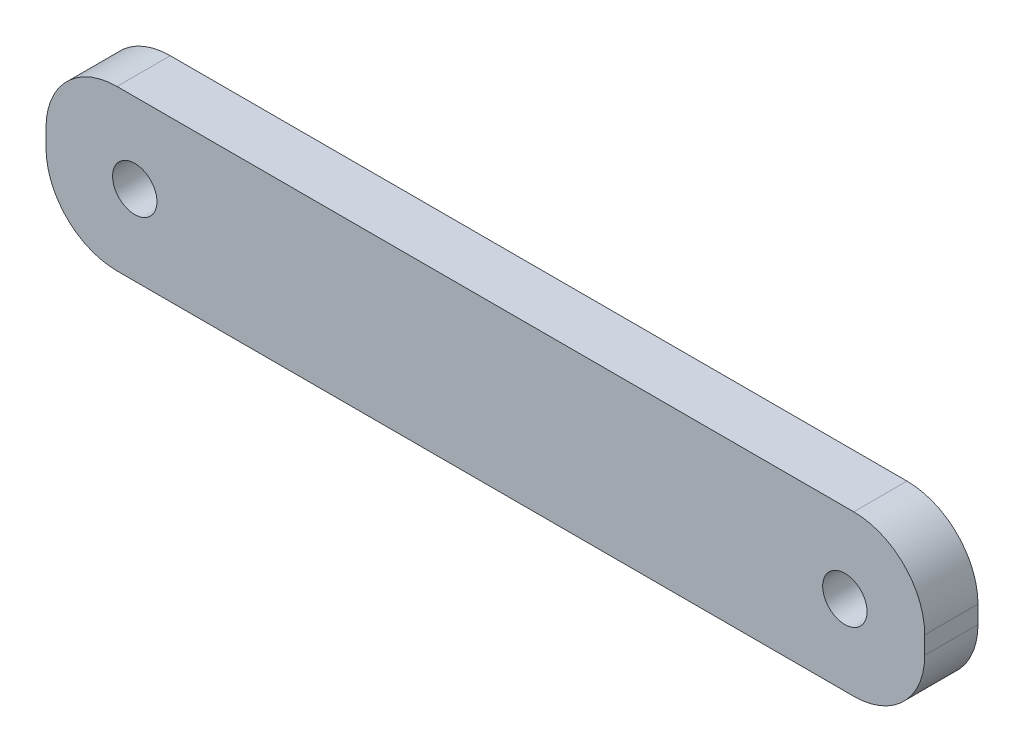
ISO-10303-21;
HEADER;
FILE_DESCRIPTION(('STEP AP214'),'2;1');
FILE_NAME('part.step','',(''),(''),'','','');
FILE_SCHEMA(('AUTOMOTIVE_DESIGN { 1 0 10303 214 1 1 1 1 }'));
ENDSEC;
DATA;
#1=APPLICATION_CONTEXT('core data for automotive mechanical design processes');
#2=APPLICATION_PROTOCOL_DEFINITION('international standard','automotive_design',2000,#1);
#3=PRODUCT_CONTEXT('',#1,'mechanical');
#4=PRODUCT('Part','Part','',(#3));
#5=PRODUCT_RELATED_PRODUCT_CATEGORY('part','',(#4));
#6=PRODUCT_DEFINITION_FORMATION('','',#4);
#7=PRODUCT_DEFINITION_CONTEXT('part definition',#1,'design');
#8=PRODUCT_DEFINITION('design','',#6,#7);
#9=PRODUCT_DEFINITION_SHAPE('','',#8);
#10=(LENGTH_UNIT() NAMED_UNIT(*) SI_UNIT(.MILLI.,.METRE.));
#11=(NAMED_UNIT(*) PLANE_ANGLE_UNIT() SI_UNIT($,.RADIAN.));
#12=(NAMED_UNIT(*) SI_UNIT($,.STERADIAN.) SOLID_ANGLE_UNIT());
#13=UNCERTAINTY_MEASURE_WITH_UNIT(LENGTH_MEASURE(1.E-05),#10,'distance_accuracy_value','');
#14=(GEOMETRIC_REPRESENTATION_CONTEXT(3) GLOBAL_UNCERTAINTY_ASSIGNED_CONTEXT((#13)) GLOBAL_UNIT_ASSIGNED_CONTEXT((#10,
#11,#12)) REPRESENTATION_CONTEXT('',''));
#15=CARTESIAN_POINT('',(0.,0.,0.));
#16=DIRECTION('',(0.,0.,1.));
#17=DIRECTION('',(1.,0.,0.));
#18=AXIS2_PLACEMENT_3D('',#15,#16,#17);
#19=CARTESIAN_POINT('',(0.,0.,-3.));
#20=DIRECTION('',(-1.,0.,0.));
#21=DIRECTION('',(0.,0.,1.));
#22=AXIS2_PLACEMENT_3D('',#19,#20,#21);
#23=PLANE('',#22);
#24=DIRECTION('',(0.,-1.,0.));
#25=VECTOR('',#24,1.);
#26=CARTESIAN_POINT('',(0.,0.,-3.));
#27=LINE('',#26,#25);
#28=CARTESIAN_POINT('',(0.,5.,-3.));
#29=VERTEX_POINT('',#28);
#30=CARTESIAN_POINT('',(0.,4.,-3.));
#31=VERTEX_POINT('',#30);
#32=EDGE_CURVE('E172',#29,#31,#27,.T.);
#33=ORIENTED_EDGE('',*,*,#32,.T.);
#34=DIRECTION('',(0.,0.,1.));
#35=VECTOR('',#34,1.);
#36=CARTESIAN_POINT('',(0.,4.,-3.));
#37=LINE('',#36,#35);
#38=CARTESIAN_POINT('',(0.,4.,0.));
#39=VERTEX_POINT('',#38);
#40=EDGE_CURVE('E13',#31,#39,#37,.T.);
#41=ORIENTED_EDGE('',*,*,#40,.T.);
#42=DIRECTION('',(0.,-1.,0.));
#43=VECTOR('',#42,1.);
#44=CARTESIAN_POINT('',(0.,0.,0.));
#45=LINE('',#44,#43);
#46=CARTESIAN_POINT('',(0.,5.,0.));
#47=VERTEX_POINT('',#46);
#48=EDGE_CURVE('E175',#47,#39,#45,.T.);
#49=ORIENTED_EDGE('',*,*,#48,.F.);
#50=DIRECTION('',(0.,0.,1.));
#51=VECTOR('',#50,1.);
#52=CARTESIAN_POINT('',(0.,5.,-3.));
#53=LINE('',#52,#51);
#54=EDGE_CURVE('E60',#47,#29,#53,.F.);
#55=ORIENTED_EDGE('',*,*,#54,.T.);
#56=EDGE_LOOP('',(#33,#41,#49,#55));
#57=FACE_BOUND('',#56,.T.);
#58=ADVANCED_FACE('F52',(#57),#23,.T.);
#59=CARTESIAN_POINT('',(0.,9.,-3.));
#60=DIRECTION('',(0.,1.,0.));
#61=DIRECTION('',(0.,0.,1.));
#62=AXIS2_PLACEMENT_3D('',#59,#60,#61);
#63=PLANE('',#62);
#64=DIRECTION('',(-1.,0.,0.));
#65=VECTOR('',#64,1.);
#66=CARTESIAN_POINT('',(0.,9.,0.));
#67=LINE('',#66,#65);
#68=CARTESIAN_POINT('',(45.5,9.,0.));
#69=VERTEX_POINT('',#68);
#70=CARTESIAN_POINT('',(4.,9.,0.));
#71=VERTEX_POINT('',#70);
#72=EDGE_CURVE('E138',#69,#71,#67,.T.);
#73=ORIENTED_EDGE('',*,*,#72,.F.);
#74=DIRECTION('',(0.,0.,1.));
#75=VECTOR('',#74,1.);
#76=CARTESIAN_POINT('',(45.5,9.,-3.));
#77=LINE('',#76,#75);
#78=CARTESIAN_POINT('',(45.5,9.,-3.));
#79=VERTEX_POINT('',#78);
#80=EDGE_CURVE('E156',#69,#79,#77,.F.);
#81=ORIENTED_EDGE('',*,*,#80,.T.);
#82=DIRECTION('',(-1.,0.,0.));
#83=VECTOR('',#82,1.);
#84=CARTESIAN_POINT('',(0.,9.,-3.));
#85=LINE('',#84,#83);
#86=CARTESIAN_POINT('',(4.,9.,-3.));
#87=VERTEX_POINT('',#86);
#88=EDGE_CURVE('E141',#79,#87,#85,.T.);
#89=ORIENTED_EDGE('',*,*,#88,.T.);
#90=DIRECTION('',(0.,0.,1.));
#91=VECTOR('',#90,1.);
#92=CARTESIAN_POINT('',(4.,9.,-3.));
#93=LINE('',#92,#91);
#94=EDGE_CURVE('E153',#87,#71,#93,.T.);
#95=ORIENTED_EDGE('',*,*,#94,.T.);
#96=EDGE_LOOP('',(#73,#81,#89,#95));
#97=FACE_BOUND('',#96,.T.);
#98=ADVANCED_FACE('F187',(#97),#63,.T.);
#99=CARTESIAN_POINT('',(49.5,0.,-3.));
#100=DIRECTION('',(1.,0.,0.));
#101=DIRECTION('',(0.,0.,-1.));
#102=AXIS2_PLACEMENT_3D('',#99,#100,#101);
#103=PLANE('',#102);
#104=DIRECTION('',(0.,1.,0.));
#105=VECTOR('',#104,1.);
#106=CARTESIAN_POINT('',(49.5,0.,-3.));
#107=LINE('',#106,#105);
#108=CARTESIAN_POINT('',(49.5,4.,-3.));
#109=VERTEX_POINT('',#108);
#110=CARTESIAN_POINT('',(49.5,5.,-3.));
#111=VERTEX_POINT('',#110);
#112=EDGE_CURVE('E146',#109,#111,#107,.T.);
#113=ORIENTED_EDGE('',*,*,#112,.T.);
#114=DIRECTION('',(0.,0.,1.));
#115=VECTOR('',#114,1.);
#116=CARTESIAN_POINT('',(49.5,5.,-3.));
#117=LINE('',#116,#115);
#118=CARTESIAN_POINT('',(49.5,5.,0.));
#119=VERTEX_POINT('',#118);
#120=EDGE_CURVE('E137',#111,#119,#117,.T.);
#121=ORIENTED_EDGE('',*,*,#120,.T.);
#122=DIRECTION('',(0.,1.,0.));
#123=VECTOR('',#122,1.);
#124=CARTESIAN_POINT('',(49.5,0.,0.));
#125=LINE('',#124,#123);
#126=CARTESIAN_POINT('',(49.5,4.,0.));
#127=VERTEX_POINT('',#126);
#128=EDGE_CURVE('E122',#127,#119,#125,.T.);
#129=ORIENTED_EDGE('',*,*,#128,.F.);
#130=DIRECTION('',(0.,0.,1.));
#131=VECTOR('',#130,1.);
#132=CARTESIAN_POINT('',(49.5,4.,-3.));
#133=LINE('',#132,#131);
#134=EDGE_CURVE('E135',#127,#109,#133,.F.);
#135=ORIENTED_EDGE('',*,*,#134,.T.);
#136=EDGE_LOOP('',(#113,#121,#129,#135));
#137=FACE_BOUND('',#136,.T.);
#138=ADVANCED_FACE('F134',(#137),#103,.T.);
#139=CARTESIAN_POINT('',(0.,0.,-3.));
#140=DIRECTION('',(0.,-1.,0.));
#141=DIRECTION('',(0.,0.,-1.));
#142=AXIS2_PLACEMENT_3D('',#139,#140,#141);
#143=PLANE('',#142);
#144=DIRECTION('',(1.,0.,0.));
#145=VECTOR('',#144,1.);
#146=CARTESIAN_POINT('',(0.,0.,-3.));
#147=LINE('',#146,#145);
#148=CARTESIAN_POINT('',(4.,0.,-3.));
#149=VERTEX_POINT('',#148);
#150=CARTESIAN_POINT('',(45.5,0.,-3.));
#151=VERTEX_POINT('',#150);
#152=EDGE_CURVE('E181',#149,#151,#147,.T.);
#153=ORIENTED_EDGE('',*,*,#152,.T.);
#154=DIRECTION('',(0.,0.,1.));
#155=VECTOR('',#154,1.);
#156=CARTESIAN_POINT('',(45.5,0.,-3.));
#157=LINE('',#156,#155);
#158=CARTESIAN_POINT('',(45.5,0.,0.));
#159=VERTEX_POINT('',#158);
#160=EDGE_CURVE('E166',#151,#159,#157,.T.);
#161=ORIENTED_EDGE('',*,*,#160,.T.);
#162=DIRECTION('',(1.,0.,0.));
#163=VECTOR('',#162,1.);
#164=CARTESIAN_POINT('',(0.,0.,0.));
#165=LINE('',#164,#163);
#166=CARTESIAN_POINT('',(4.,0.,0.));
#167=VERTEX_POINT('',#166);
#168=EDGE_CURVE('E123',#167,#159,#165,.T.);
#169=ORIENTED_EDGE('',*,*,#168,.F.);
#170=DIRECTION('',(0.,0.,1.));
#171=VECTOR('',#170,1.);
#172=CARTESIAN_POINT('',(4.,0.,-3.));
#173=LINE('',#172,#171);
#174=EDGE_CURVE('E74',#167,#149,#173,.F.);
#175=ORIENTED_EDGE('',*,*,#174,.T.);
#176=EDGE_LOOP('',(#153,#161,#169,#175));
#177=FACE_BOUND('',#176,.T.);
#178=ADVANCED_FACE('F239',(#177),#143,.T.);
#179=CARTESIAN_POINT('',(0.,0.,-3.));
#180=DIRECTION('',(0.,0.,-1.));
#181=DIRECTION('',(-1.,0.,0.));
#182=AXIS2_PLACEMENT_3D('',#179,#180,#181);
#183=PLANE('',#182);
#184=CARTESIAN_POINT('',(45.,4.5,-3.));
#185=DIRECTION('',(0.,0.,1.));
#186=DIRECTION('',(1.,0.,0.));
#187=AXIS2_PLACEMENT_3D('',#184,#185,#186);
#188=CIRCLE('',#187,1.25);
#189=CARTESIAN_POINT('',(46.25,4.5,-3.));
#190=VERTEX_POINT('',#189);
#191=EDGE_CURVE('E203',#190,#190,#188,.T.);
#192=ORIENTED_EDGE('',*,*,#191,.T.);
#193=EDGE_LOOP('',(#192));
#194=FACE_BOUND('',#193,.T.);
#195=CARTESIAN_POINT('',(5.,4.5,-3.));
#196=DIRECTION('',(0.,0.,1.));
#197=DIRECTION('',(1.,0.,0.));
#198=AXIS2_PLACEMENT_3D('',#195,#196,#197);
#199=CIRCLE('',#198,1.25);
#200=CARTESIAN_POINT('',(6.25,4.5,-3.));
#201=VERTEX_POINT('',#200);
#202=EDGE_CURVE('E196',#201,#201,#199,.T.);
#203=ORIENTED_EDGE('',*,*,#202,.T.);
#204=EDGE_LOOP('',(#203));
#205=FACE_BOUND('',#204,.T.);
#206=ORIENTED_EDGE('',*,*,#88,.F.);
#207=CARTESIAN_POINT('',(45.5,5.,-3.));
#208=DIRECTION('',(0.,0.,-1.));
#209=DIRECTION('',(-1.,0.,0.));
#210=AXIS2_PLACEMENT_3D('',#207,#208,#209);
#211=CIRCLE('',#210,4.);
#212=EDGE_CURVE('E163',#79,#111,#211,.T.);
#213=ORIENTED_EDGE('',*,*,#212,.T.);
#214=ORIENTED_EDGE('',*,*,#112,.F.);
#215=CARTESIAN_POINT('',(45.5,4.,-3.));
#216=DIRECTION('',(0.,0.,-1.));
#217=DIRECTION('',(-1.,0.,0.));
#218=AXIS2_PLACEMENT_3D('',#215,#216,#217);
#219=CIRCLE('',#218,4.);
#220=EDGE_CURVE('E67',#109,#151,#219,.T.);
#221=ORIENTED_EDGE('',*,*,#220,.T.);
#222=ORIENTED_EDGE('',*,*,#152,.F.);
#223=CARTESIAN_POINT('',(4.,4.,-3.));
#224=DIRECTION('',(0.,0.,-1.));
#225=DIRECTION('',(-1.,0.,0.));
#226=AXIS2_PLACEMENT_3D('',#223,#224,#225);
#227=CIRCLE('',#226,4.);
#228=EDGE_CURVE('E160',#149,#31,#227,.T.);
#229=ORIENTED_EDGE('',*,*,#228,.T.);
#230=ORIENTED_EDGE('',*,*,#32,.F.);
#231=CARTESIAN_POINT('',(4.,5.,-3.));
#232=DIRECTION('',(0.,0.,-1.));
#233=DIRECTION('',(-1.,0.,0.));
#234=AXIS2_PLACEMENT_3D('',#231,#232,#233);
#235=CIRCLE('',#234,4.);
#236=EDGE_CURVE('E158',#29,#87,#235,.T.);
#237=ORIENTED_EDGE('',*,*,#236,.T.);
#238=EDGE_LOOP('',(#206,#213,#214,#221,#222,#229,#230,#237));
#239=FACE_BOUND('',#238,.T.);
#240=ADVANCED_FACE('F179',(#194,#205,#239),#183,.T.);
#241=CARTESIAN_POINT('',(0.,0.,0.));
#242=DIRECTION('',(0.,0.,-1.));
#243=DIRECTION('',(-1.,0.,0.));
#244=AXIS2_PLACEMENT_3D('',#241,#242,#243);
#245=PLANE('',#244);
#246=CARTESIAN_POINT('',(45.,4.5,0.));
#247=DIRECTION('',(0.,0.,1.));
#248=DIRECTION('',(1.,0.,0.));
#249=AXIS2_PLACEMENT_3D('',#246,#247,#248);
#250=CIRCLE('',#249,1.25);
#251=CARTESIAN_POINT('',(46.25,4.5,0.));
#252=VERTEX_POINT('',#251);
#253=EDGE_CURVE('E206',#252,#252,#250,.T.);
#254=ORIENTED_EDGE('',*,*,#253,.F.);
#255=EDGE_LOOP('',(#254));
#256=FACE_BOUND('',#255,.T.);
#257=CARTESIAN_POINT('',(5.,4.5,0.));
#258=DIRECTION('',(0.,0.,1.));
#259=DIRECTION('',(1.,0.,0.));
#260=AXIS2_PLACEMENT_3D('',#257,#258,#259);
#261=CIRCLE('',#260,1.25);
#262=CARTESIAN_POINT('',(6.25,4.5,0.));
#263=VERTEX_POINT('',#262);
#264=EDGE_CURVE('E198',#263,#263,#261,.T.);
#265=ORIENTED_EDGE('',*,*,#264,.F.);
#266=EDGE_LOOP('',(#265));
#267=FACE_BOUND('',#266,.T.);
#268=ORIENTED_EDGE('',*,*,#128,.T.);
#269=CARTESIAN_POINT('',(45.5,5.,0.));
#270=DIRECTION('',(0.,0.,-1.));
#271=DIRECTION('',(-1.,0.,0.));
#272=AXIS2_PLACEMENT_3D('',#269,#270,#271);
#273=CIRCLE('',#272,4.);
#274=EDGE_CURVE('E128',#119,#69,#273,.F.);
#275=ORIENTED_EDGE('',*,*,#274,.T.);
#276=ORIENTED_EDGE('',*,*,#72,.T.);
#277=CARTESIAN_POINT('',(4.,5.,0.));
#278=DIRECTION('',(0.,0.,-1.));
#279=DIRECTION('',(-1.,0.,0.));
#280=AXIS2_PLACEMENT_3D('',#277,#278,#279);
#281=CIRCLE('',#280,4.);
#282=EDGE_CURVE('E143',#71,#47,#281,.F.);
#283=ORIENTED_EDGE('',*,*,#282,.T.);
#284=ORIENTED_EDGE('',*,*,#48,.T.);
#285=CARTESIAN_POINT('',(4.,4.,0.));
#286=DIRECTION('',(0.,0.,-1.));
#287=DIRECTION('',(-1.,0.,0.));
#288=AXIS2_PLACEMENT_3D('',#285,#286,#287);
#289=CIRCLE('',#288,4.);
#290=EDGE_CURVE('E129',#39,#167,#289,.F.);
#291=ORIENTED_EDGE('',*,*,#290,.T.);
#292=ORIENTED_EDGE('',*,*,#168,.T.);
#293=CARTESIAN_POINT('',(45.5,4.,0.));
#294=DIRECTION('',(0.,0.,-1.));
#295=DIRECTION('',(-1.,0.,0.));
#296=AXIS2_PLACEMENT_3D('',#293,#294,#295);
#297=CIRCLE('',#296,4.);
#298=EDGE_CURVE('E119',#159,#127,#297,.F.);
#299=ORIENTED_EDGE('',*,*,#298,.T.);
#300=EDGE_LOOP('',(#268,#275,#276,#283,#284,#291,#292,#299));
#301=FACE_BOUND('',#300,.T.);
#302=ADVANCED_FACE('F121',(#256,#267,#301),#245,.F.);
#303=CARTESIAN_POINT('',(5.,4.5,-3.));
#304=DIRECTION('',(0.,0.,1.));
#305=DIRECTION('',(1.,0.,0.));
#306=AXIS2_PLACEMENT_3D('',#303,#304,#305);
#307=CYLINDRICAL_SURFACE('',#306,1.25);
#308=ORIENTED_EDGE('',*,*,#202,.F.);
#309=EDGE_LOOP('',(#308));
#310=FACE_BOUND('',#309,.T.);
#311=ORIENTED_EDGE('',*,*,#264,.T.);
#312=EDGE_LOOP('',(#311));
#313=FACE_BOUND('',#312,.T.);
#314=ADVANCED_FACE('F216',(#310,#313),#307,.F.);
#315=CARTESIAN_POINT('',(45.,4.5,-3.));
#316=DIRECTION('',(0.,0.,1.));
#317=DIRECTION('',(1.,0.,0.));
#318=AXIS2_PLACEMENT_3D('',#315,#316,#317);
#319=CYLINDRICAL_SURFACE('',#318,1.25);
#320=ORIENTED_EDGE('',*,*,#191,.F.);
#321=EDGE_LOOP('',(#320));
#322=FACE_BOUND('',#321,.T.);
#323=ORIENTED_EDGE('',*,*,#253,.T.);
#324=EDGE_LOOP('',(#323));
#325=FACE_BOUND('',#324,.T.);
#326=ADVANCED_FACE('F213',(#322,#325),#319,.F.);
#327=CARTESIAN_POINT('',(45.5,5.,-3.));
#328=DIRECTION('',(0.,0.,1.));
#329=DIRECTION('',(1.,0.,0.));
#330=AXIS2_PLACEMENT_3D('',#327,#328,#329);
#331=CYLINDRICAL_SURFACE('',#330,4.);
#332=ORIENTED_EDGE('',*,*,#212,.F.);
#333=ORIENTED_EDGE('',*,*,#80,.F.);
#334=ORIENTED_EDGE('',*,*,#274,.F.);
#335=ORIENTED_EDGE('',*,*,#120,.F.);
#336=EDGE_LOOP('',(#332,#333,#334,#335));
#337=FACE_BOUND('',#336,.T.);
#338=ADVANCED_FACE('F191',(#337),#331,.T.);
#339=CARTESIAN_POINT('',(45.5,4.,-3.));
#340=DIRECTION('',(0.,0.,1.));
#341=DIRECTION('',(1.,0.,0.));
#342=AXIS2_PLACEMENT_3D('',#339,#340,#341);
#343=CYLINDRICAL_SURFACE('',#342,4.);
#344=ORIENTED_EDGE('',*,*,#220,.F.);
#345=ORIENTED_EDGE('',*,*,#134,.F.);
#346=ORIENTED_EDGE('',*,*,#298,.F.);
#347=ORIENTED_EDGE('',*,*,#160,.F.);
#348=EDGE_LOOP('',(#344,#345,#346,#347));
#349=FACE_BOUND('',#348,.T.);
#350=ADVANCED_FACE('F140',(#349),#343,.T.);
#351=CARTESIAN_POINT('',(4.,4.,-3.));
#352=DIRECTION('',(0.,0.,1.));
#353=DIRECTION('',(1.,0.,0.));
#354=AXIS2_PLACEMENT_3D('',#351,#352,#353);
#355=CYLINDRICAL_SURFACE('',#354,4.);
#356=ORIENTED_EDGE('',*,*,#228,.F.);
#357=ORIENTED_EDGE('',*,*,#174,.F.);
#358=ORIENTED_EDGE('',*,*,#290,.F.);
#359=ORIENTED_EDGE('',*,*,#40,.F.);
#360=EDGE_LOOP('',(#356,#357,#358,#359));
#361=FACE_BOUND('',#360,.T.);
#362=ADVANCED_FACE('F244',(#361),#355,.T.);
#363=CARTESIAN_POINT('',(4.,5.,-3.));
#364=DIRECTION('',(0.,0.,1.));
#365=DIRECTION('',(1.,0.,0.));
#366=AXIS2_PLACEMENT_3D('',#363,#364,#365);
#367=CYLINDRICAL_SURFACE('',#366,4.);
#368=ORIENTED_EDGE('',*,*,#236,.F.);
#369=ORIENTED_EDGE('',*,*,#54,.F.);
#370=ORIENTED_EDGE('',*,*,#282,.F.);
#371=ORIENTED_EDGE('',*,*,#94,.F.);
#372=EDGE_LOOP('',(#368,#369,#370,#371));
#373=FACE_BOUND('',#372,.T.);
#374=ADVANCED_FACE('F54',(#373),#367,.T.);
#375=CLOSED_SHELL('',(#58,#98,#138,#178,#240,#302,#314,#326,#338,#350,#362,#374));
#376=MANIFOLD_SOLID_BREP('B2',#375);
#377=ADVANCED_BREP_SHAPE_REPRESENTATION('',(#18,#376),#14);
#378=SHAPE_DEFINITION_REPRESENTATION(#9,#377);
ENDSEC;
END-ISO-10303-21;
